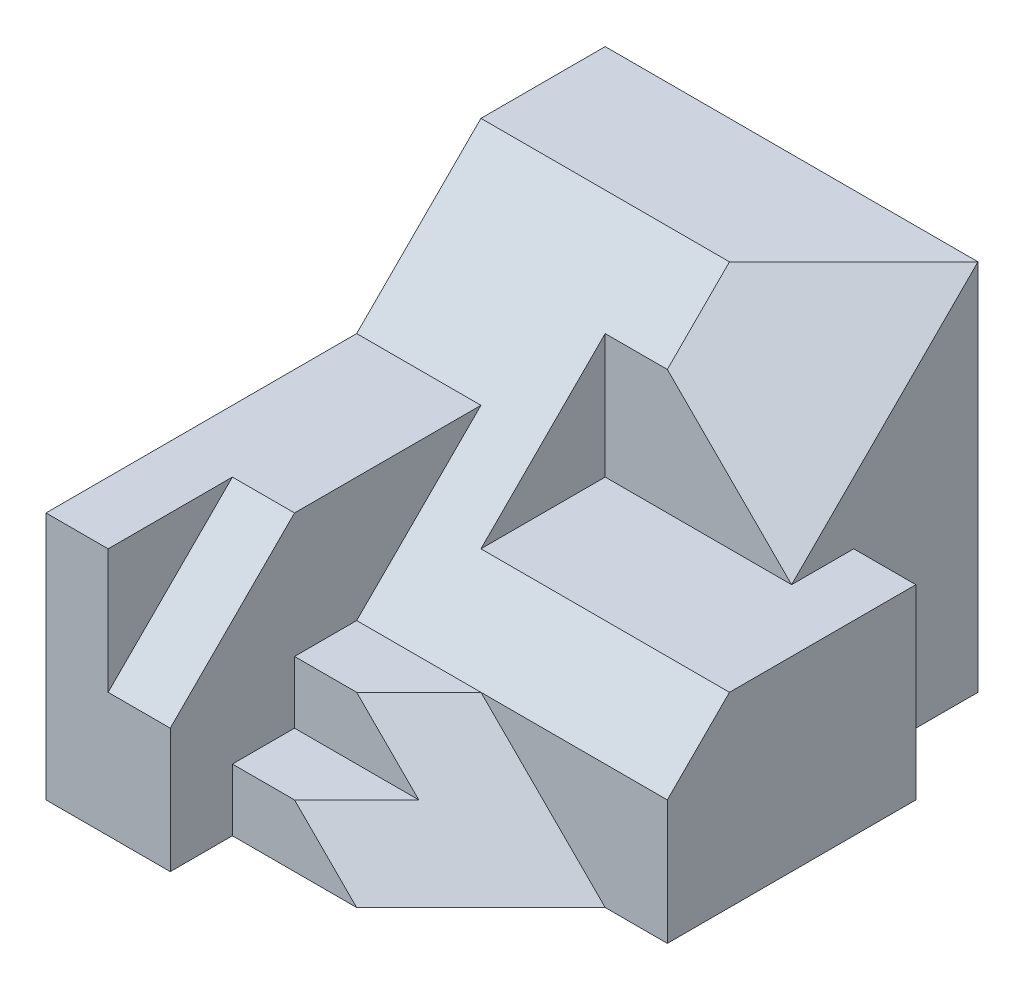
ISO-10303-21;
HEADER;
FILE_DESCRIPTION(('STEP AP214'),'2;1');
FILE_NAME('part.step','',(''),(''),'','','');
FILE_SCHEMA(('AUTOMOTIVE_DESIGN { 1 0 10303 214 1 1 1 1 }'));
ENDSEC;
DATA;
#1=APPLICATION_CONTEXT('core data for automotive mechanical design processes');
#2=APPLICATION_PROTOCOL_DEFINITION('international standard','automotive_design',2000,#1);
#3=PRODUCT_CONTEXT('',#1,'mechanical');
#4=PRODUCT('Part','Part','',(#3));
#5=PRODUCT_RELATED_PRODUCT_CATEGORY('part','',(#4));
#6=PRODUCT_DEFINITION_FORMATION('','',#4);
#7=PRODUCT_DEFINITION_CONTEXT('part definition',#1,'design');
#8=PRODUCT_DEFINITION('design','',#6,#7);
#9=PRODUCT_DEFINITION_SHAPE('','',#8);
#10=(LENGTH_UNIT() NAMED_UNIT(*) SI_UNIT(.MILLI.,.METRE.));
#11=(NAMED_UNIT(*) PLANE_ANGLE_UNIT() SI_UNIT($,.RADIAN.));
#12=(NAMED_UNIT(*) SI_UNIT($,.STERADIAN.) SOLID_ANGLE_UNIT());
#13=UNCERTAINTY_MEASURE_WITH_UNIT(LENGTH_MEASURE(1.E-05),#10,'distance_accuracy_value','');
#14=(GEOMETRIC_REPRESENTATION_CONTEXT(3) GLOBAL_UNCERTAINTY_ASSIGNED_CONTEXT((#13)) GLOBAL_UNIT_ASSIGNED_CONTEXT((#10,
#11,#12)) REPRESENTATION_CONTEXT('',''));
#15=CARTESIAN_POINT('',(0.,0.,0.));
#16=DIRECTION('',(0.,0.,1.));
#17=DIRECTION('',(1.,0.,0.));
#18=AXIS2_PLACEMENT_3D('',#15,#16,#17);
#19=CARTESIAN_POINT('',(2.5,-2.,7.));
#20=DIRECTION('',(0.,-1.,0.));
#21=DIRECTION('',(0.,0.,-1.));
#22=AXIS2_PLACEMENT_3D('',#19,#20,#21);
#23=PLANE('',#22);
#24=DIRECTION('',(-1.,0.,0.));
#25=VECTOR('',#24,1.);
#26=CARTESIAN_POINT('',(2.5,-2.,8.));
#27=LINE('',#26,#25);
#28=CARTESIAN_POINT('',(-0.5,-2.,8.));
#29=VERTEX_POINT('',#28);
#30=CARTESIAN_POINT('',(-1.5,-2.,8.));
#31=VERTEX_POINT('',#30);
#32=EDGE_CURVE('E233',#29,#31,#27,.T.);
#33=ORIENTED_EDGE('',*,*,#32,.F.);
#34=DIRECTION('',(-0.707106781186548,0.,0.707106781186547));
#35=VECTOR('',#34,1.);
#36=CARTESIAN_POINT('',(1.5,-2.,6.));
#37=LINE('',#36,#35);
#38=CARTESIAN_POINT('',(0.500000000000001,-2.,7.));
#39=VERTEX_POINT('',#38);
#40=EDGE_CURVE('E244',#39,#29,#37,.T.);
#41=ORIENTED_EDGE('',*,*,#40,.F.);
#42=DIRECTION('',(-1.,0.,0.));
#43=VECTOR('',#42,1.);
#44=CARTESIAN_POINT('',(2.5,-2.,7.));
#45=LINE('',#44,#43);
#46=CARTESIAN_POINT('',(-1.5,-2.,7.));
#47=VERTEX_POINT('',#46);
#48=EDGE_CURVE('E230',#39,#47,#45,.T.);
#49=ORIENTED_EDGE('',*,*,#48,.T.);
#50=DIRECTION('',(0.,0.,1.));
#51=VECTOR('',#50,1.);
#52=CARTESIAN_POINT('',(-1.5,-2.,7.));
#53=LINE('',#52,#51);
#54=EDGE_CURVE('E232',#47,#31,#53,.T.);
#55=ORIENTED_EDGE('',*,*,#54,.T.);
#56=EDGE_LOOP('',(#33,#41,#49,#55));
#57=FACE_BOUND('',#56,.T.);
#58=ADVANCED_FACE('F33',(#57),#23,.F.);
#59=CARTESIAN_POINT('',(2.5,-2.,8.));
#60=DIRECTION('',(0.,0.,-1.));
#61=DIRECTION('',(-1.,0.,0.));
#62=AXIS2_PLACEMENT_3D('',#59,#60,#61);
#63=PLANE('',#62);
#64=DIRECTION('',(0.707106781186547,-0.707106781186548,0.));
#65=VECTOR('',#64,1.);
#66=CARTESIAN_POINT('',(-0.5,-2.,8.));
#67=LINE('',#66,#65);
#68=CARTESIAN_POINT('',(0.499999999999998,-3.,8.));
#69=VERTEX_POINT('',#68);
#70=EDGE_CURVE('E249',#29,#69,#67,.T.);
#71=ORIENTED_EDGE('',*,*,#70,.F.);
#72=ORIENTED_EDGE('',*,*,#32,.T.);
#73=DIRECTION('',(0.,-1.,0.));
#74=VECTOR('',#73,1.);
#75=CARTESIAN_POINT('',(-1.5,-2.,8.));
#76=LINE('',#75,#74);
#77=CARTESIAN_POINT('',(-1.5,-3.,8.));
#78=VERTEX_POINT('',#77);
#79=EDGE_CURVE('E210',#31,#78,#76,.T.);
#80=ORIENTED_EDGE('',*,*,#79,.T.);
#81=DIRECTION('',(-1.,0.,0.));
#82=VECTOR('',#81,1.);
#83=CARTESIAN_POINT('',(2.5,-3.,8.));
#84=LINE('',#83,#82);
#85=EDGE_CURVE('E37',#69,#78,#84,.T.);
#86=ORIENTED_EDGE('',*,*,#85,.F.);
#87=EDGE_LOOP('',(#71,#72,#80,#86));
#88=FACE_BOUND('',#87,.T.);
#89=ADVANCED_FACE('F348',(#88),#63,.F.);
#90=CARTESIAN_POINT('',(3.5,-3.,9.));
#91=DIRECTION('',(0.,1.,0.));
#92=DIRECTION('',(-1.,0.,0.));
#93=AXIS2_PLACEMENT_3D('',#90,#91,#92);
#94=PLANE('',#93);
#95=DIRECTION('',(0.707106781186547,0.,-0.707106781186548));
#96=VECTOR('',#95,1.);
#97=CARTESIAN_POINT('',(1.5,-3.,7.));
#98=LINE('',#97,#96);
#99=CARTESIAN_POINT('',(2.5,-3.,6.));
#100=VERTEX_POINT('',#99);
#101=EDGE_CURVE('E177',#69,#100,#98,.T.);
#102=ORIENTED_EDGE('',*,*,#101,.F.);
#103=ORIENTED_EDGE('',*,*,#85,.T.);
#104=DIRECTION('',(0.,0.,-1.));
#105=VECTOR('',#104,1.);
#106=CARTESIAN_POINT('',(-1.5,-3.,9.));
#107=LINE('',#106,#105);
#108=CARTESIAN_POINT('',(-1.5,-3.,9.));
#109=VERTEX_POINT('',#108);
#110=EDGE_CURVE('E211',#109,#78,#107,.T.);
#111=ORIENTED_EDGE('',*,*,#110,.F.);
#112=DIRECTION('',(1.,0.,0.));
#113=VECTOR('',#112,1.);
#114=CARTESIAN_POINT('',(3.5,-3.,9.));
#115=LINE('',#114,#113);
#116=CARTESIAN_POINT('',(-3.5,-3.,9.));
#117=VERTEX_POINT('',#116);
#118=EDGE_CURVE('E267',#117,#109,#115,.T.);
#119=ORIENTED_EDGE('',*,*,#118,.F.);
#120=DIRECTION('',(0.,0.,-1.));
#121=VECTOR('',#120,1.);
#122=CARTESIAN_POINT('',(-3.5,-3.,9.));
#123=LINE('',#122,#121);
#124=CARTESIAN_POINT('',(-3.5,-3.,0.));
#125=VERTEX_POINT('',#124);
#126=EDGE_CURVE('E250',#117,#125,#123,.T.);
#127=ORIENTED_EDGE('',*,*,#126,.T.);
#128=DIRECTION('',(1.,0.,0.));
#129=VECTOR('',#128,1.);
#130=CARTESIAN_POINT('',(3.5,-3.,0.));
#131=LINE('',#130,#129);
#132=CARTESIAN_POINT('',(2.5,-3.,0.));
#133=VERTEX_POINT('',#132);
#134=EDGE_CURVE('E253',#125,#133,#131,.T.);
#135=ORIENTED_EDGE('',*,*,#134,.T.);
#136=DIRECTION('',(0.,0.,-1.));
#137=VECTOR('',#136,1.);
#138=CARTESIAN_POINT('',(2.5,-3.,0.));
#139=LINE('',#138,#137);
#140=CARTESIAN_POINT('',(2.5,-3.,2.));
#141=VERTEX_POINT('',#140);
#142=EDGE_CURVE('E290',#141,#133,#139,.T.);
#143=ORIENTED_EDGE('',*,*,#142,.F.);
#144=DIRECTION('',(1.,0.,0.));
#145=VECTOR('',#144,1.);
#146=CARTESIAN_POINT('',(2.5,-3.,2.));
#147=LINE('',#146,#145);
#148=CARTESIAN_POINT('',(3.5,-3.,2.));
#149=VERTEX_POINT('',#148);
#150=EDGE_CURVE('E242',#141,#149,#147,.T.);
#151=ORIENTED_EDGE('',*,*,#150,.T.);
#152=DIRECTION('',(0.,0.,-1.));
#153=VECTOR('',#152,1.);
#154=CARTESIAN_POINT('',(3.5,-3.,9.));
#155=LINE('',#154,#153);
#156=CARTESIAN_POINT('',(3.5,-3.,6.));
#157=VERTEX_POINT('',#156);
#158=EDGE_CURVE('E254',#157,#149,#155,.T.);
#159=ORIENTED_EDGE('',*,*,#158,.F.);
#160=DIRECTION('',(1.,0.,0.));
#161=VECTOR('',#160,1.);
#162=CARTESIAN_POINT('',(-1.5,-3.,6.));
#163=LINE('',#162,#161);
#164=EDGE_CURVE('E197',#100,#157,#163,.T.);
#165=ORIENTED_EDGE('',*,*,#164,.F.);
#166=EDGE_LOOP('',(#102,#103,#111,#119,#127,#135,#143,#151,#159,#165));
#167=FACE_BOUND('',#166,.T.);
#168=ADVANCED_FACE('F35',(#167),#94,.F.);
#169=CARTESIAN_POINT('',(2.5,-0.999999999999999,6.));
#170=DIRECTION('',(0.,-1.,0.));
#171=DIRECTION('',(0.,0.,-1.));
#172=AXIS2_PLACEMENT_3D('',#169,#170,#171);
#173=PLANE('',#172);
#174=DIRECTION('',(-0.707106781186547,0.,0.707106781186548));
#175=VECTOR('',#174,1.);
#176=CARTESIAN_POINT('',(-0.500000000000002,-0.999999999999998,7.));
#177=LINE('',#176,#175);
#178=CARTESIAN_POINT('',(0.499999999999999,-0.999999999999998,6.));
#179=VERTEX_POINT('',#178);
#180=CARTESIAN_POINT('',(-0.500000000000002,-0.999999999999998,7.));
#181=VERTEX_POINT('',#180);
#182=EDGE_CURVE('E11',#179,#181,#177,.T.);
#183=ORIENTED_EDGE('',*,*,#182,.F.);
#184=DIRECTION('',(1.,0.,0.));
#185=VECTOR('',#184,1.);
#186=CARTESIAN_POINT('',(-1.5,-0.999999999999999,6.));
#187=LINE('',#186,#185);
#188=CARTESIAN_POINT('',(-1.5,-0.999999999999999,6.));
#189=VERTEX_POINT('',#188);
#190=EDGE_CURVE('E173',#189,#179,#187,.T.);
#191=ORIENTED_EDGE('',*,*,#190,.F.);
#192=DIRECTION('',(0.,0.,1.));
#193=VECTOR('',#192,1.);
#194=CARTESIAN_POINT('',(-1.5,-0.999999999999999,6.));
#195=LINE('',#194,#193);
#196=CARTESIAN_POINT('',(-1.5,-0.999999999999999,7.));
#197=VERTEX_POINT('',#196);
#198=EDGE_CURVE('E229',#189,#197,#195,.T.);
#199=ORIENTED_EDGE('',*,*,#198,.T.);
#200=DIRECTION('',(-1.,0.,0.));
#201=VECTOR('',#200,1.);
#202=CARTESIAN_POINT('',(2.5,-0.999999999999999,7.));
#203=LINE('',#202,#201);
#204=EDGE_CURVE('E185',#181,#197,#203,.T.);
#205=ORIENTED_EDGE('',*,*,#204,.F.);
#206=EDGE_LOOP('',(#183,#191,#199,#205));
#207=FACE_BOUND('',#206,.T.);
#208=ADVANCED_FACE('F183',(#207),#173,.F.);
#209=CARTESIAN_POINT('',(2.5,-0.999999999999999,7.));
#210=DIRECTION('',(0.,0.,-1.));
#211=DIRECTION('',(-1.,0.,0.));
#212=AXIS2_PLACEMENT_3D('',#209,#210,#211);
#213=PLANE('',#212);
#214=DIRECTION('',(0.707106781186547,-0.707106781186548,0.));
#215=VECTOR('',#214,1.);
#216=CARTESIAN_POINT('',(0.999999999999999,-2.5,7.));
#217=LINE('',#216,#215);
#218=EDGE_CURVE('E52',#181,#39,#217,.T.);
#219=ORIENTED_EDGE('',*,*,#218,.F.);
#220=ORIENTED_EDGE('',*,*,#204,.T.);
#221=DIRECTION('',(0.,-1.,0.));
#222=VECTOR('',#221,1.);
#223=CARTESIAN_POINT('',(-1.5,-0.999999999999999,7.));
#224=LINE('',#223,#222);
#225=EDGE_CURVE('E228',#197,#47,#224,.T.);
#226=ORIENTED_EDGE('',*,*,#225,.T.);
#227=ORIENTED_EDGE('',*,*,#48,.F.);
#228=EDGE_LOOP('',(#219,#220,#226,#227));
#229=FACE_BOUND('',#228,.T.);
#230=ADVANCED_FACE('F353',(#229),#213,.F.);
#231=CARTESIAN_POINT('',(-1.5,0.,0.));
#232=DIRECTION('',(1.,0.,0.));
#233=DIRECTION('',(0.,0.,-1.));
#234=AXIS2_PLACEMENT_3D('',#231,#232,#233);
#235=PLANE('',#234);
#236=ORIENTED_EDGE('',*,*,#225,.F.);
#237=ORIENTED_EDGE('',*,*,#198,.F.);
#238=DIRECTION('',(0.,0.707106781186547,-0.707106781186548));
#239=VECTOR('',#238,1.);
#240=CARTESIAN_POINT('',(-1.5,0.,5.));
#241=LINE('',#240,#239);
#242=CARTESIAN_POINT('',(-1.5,1.,4.));
#243=VERTEX_POINT('',#242);
#244=EDGE_CURVE('E190',#189,#243,#241,.T.);
#245=ORIENTED_EDGE('',*,*,#244,.T.);
#246=DIRECTION('',(0.,0.,1.));
#247=VECTOR('',#246,1.);
#248=CARTESIAN_POINT('',(-1.5,1.,6.));
#249=LINE('',#248,#247);
#250=CARTESIAN_POINT('',(-1.5,1.,7.));
#251=VERTEX_POINT('',#250);
#252=EDGE_CURVE('E209',#243,#251,#249,.T.);
#253=ORIENTED_EDGE('',*,*,#252,.T.);
#254=DIRECTION('',(0.,-0.707106781186548,0.707106781186548));
#255=VECTOR('',#254,1.);
#256=CARTESIAN_POINT('',(-1.5,1.,7.));
#257=LINE('',#256,#255);
#258=CARTESIAN_POINT('',(-1.5,-0.999999999999999,9.));
#259=VERTEX_POINT('',#258);
#260=EDGE_CURVE('E217',#251,#259,#257,.T.);
#261=ORIENTED_EDGE('',*,*,#260,.T.);
#262=DIRECTION('',(0.,-1.,0.));
#263=VECTOR('',#262,1.);
#264=CARTESIAN_POINT('',(-1.5,-0.999999999999999,9.));
#265=LINE('',#264,#263);
#266=EDGE_CURVE('E215',#259,#109,#265,.T.);
#267=ORIENTED_EDGE('',*,*,#266,.T.);
#268=ORIENTED_EDGE('',*,*,#110,.T.);
#269=ORIENTED_EDGE('',*,*,#79,.F.);
#270=ORIENTED_EDGE('',*,*,#54,.F.);
#271=EDGE_LOOP('',(#236,#237,#245,#253,#261,#267,#268,#269,#270));
#272=FACE_BOUND('',#271,.T.);
#273=ADVANCED_FACE('F345',(#272),#235,.T.);
#274=CARTESIAN_POINT('',(3.5,3.,9.));
#275=DIRECTION('',(0.,-1.,0.));
#276=DIRECTION('',(1.,0.,0.));
#277=AXIS2_PLACEMENT_3D('',#274,#275,#276);
#278=PLANE('',#277);
#279=DIRECTION('',(-0.707106781186547,0.,0.707106781186548));
#280=VECTOR('',#279,1.);
#281=CARTESIAN_POINT('',(2.5,3.,0.));
#282=LINE('',#281,#280);
#283=CARTESIAN_POINT('',(2.5,3.,0.));
#284=VERTEX_POINT('',#283);
#285=CARTESIAN_POINT('',(0.499999999999999,3.,2.));
#286=VERTEX_POINT('',#285);
#287=EDGE_CURVE('E207',#284,#286,#282,.T.);
#288=ORIENTED_EDGE('',*,*,#287,.F.);
#289=DIRECTION('',(-1.,0.,0.));
#290=VECTOR('',#289,1.);
#291=CARTESIAN_POINT('',(3.5,3.,0.));
#292=LINE('',#291,#290);
#293=CARTESIAN_POINT('',(-3.5,3.,0.));
#294=VERTEX_POINT('',#293);
#295=EDGE_CURVE('E214',#284,#294,#292,.T.);
#296=ORIENTED_EDGE('',*,*,#295,.T.);
#297=DIRECTION('',(0.,0.,-1.));
#298=VECTOR('',#297,1.);
#299=CARTESIAN_POINT('',(-3.5,3.,9.));
#300=LINE('',#299,#298);
#301=CARTESIAN_POINT('',(-3.5,3.,2.));
#302=VERTEX_POINT('',#301);
#303=EDGE_CURVE('E256',#302,#294,#300,.T.);
#304=ORIENTED_EDGE('',*,*,#303,.F.);
#305=DIRECTION('',(-1.,0.,0.));
#306=VECTOR('',#305,1.);
#307=CARTESIAN_POINT('',(-1.5,3.,2.));
#308=LINE('',#307,#306);
#309=EDGE_CURVE('E193',#286,#302,#308,.T.);
#310=ORIENTED_EDGE('',*,*,#309,.F.);
#311=EDGE_LOOP('',(#288,#296,#304,#310));
#312=FACE_BOUND('',#311,.T.);
#313=ADVANCED_FACE('F360',(#312),#278,.F.);
#314=CARTESIAN_POINT('',(-1.5,3.,2.));
#315=DIRECTION('',(0.,-0.707106781186547,-0.707106781186548));
#316=DIRECTION('',(0.,0.707106781186548,-0.707106781186547));
#317=AXIS2_PLACEMENT_3D('',#314,#315,#316);
#318=PLANE('',#317);
#319=DIRECTION('',(0.,-0.707106781186548,0.707106781186548));
#320=VECTOR('',#319,1.);
#321=CARTESIAN_POINT('',(0.499999999999999,3.,2.));
#322=LINE('',#321,#320);
#323=CARTESIAN_POINT('',(0.499999999999999,2.,3.));
#324=VERTEX_POINT('',#323);
#325=EDGE_CURVE('E224',#286,#324,#322,.T.);
#326=ORIENTED_EDGE('',*,*,#325,.F.);
#327=ORIENTED_EDGE('',*,*,#309,.T.);
#328=DIRECTION('',(0.,-0.707106781186548,0.707106781186547));
#329=VECTOR('',#328,1.);
#330=CARTESIAN_POINT('',(-3.5,3.,2.));
#331=LINE('',#330,#329);
#332=CARTESIAN_POINT('',(-3.5,1.,4.));
#333=VERTEX_POINT('',#332);
#334=EDGE_CURVE('E191',#302,#333,#331,.T.);
#335=ORIENTED_EDGE('',*,*,#334,.T.);
#336=DIRECTION('',(-1.,0.,0.));
#337=VECTOR('',#336,1.);
#338=CARTESIAN_POINT('',(-1.5,1.,4.));
#339=LINE('',#338,#337);
#340=EDGE_CURVE('E275',#243,#333,#339,.T.);
#341=ORIENTED_EDGE('',*,*,#340,.F.);
#342=ORIENTED_EDGE('',*,*,#244,.F.);
#343=ORIENTED_EDGE('',*,*,#190,.T.);
#344=CARTESIAN_POINT('',(3.5,-0.999999999999999,6.));
#345=VERTEX_POINT('',#344);
#346=EDGE_CURVE('E164',#179,#345,#187,.T.);
#347=ORIENTED_EDGE('',*,*,#346,.T.);
#348=DIRECTION('',(0.,0.707106781186547,-0.707106781186548));
#349=VECTOR('',#348,1.);
#350=CARTESIAN_POINT('',(3.5,0.,5.));
#351=LINE('',#350,#349);
#352=CARTESIAN_POINT('',(3.5,0.,5.));
#353=VERTEX_POINT('',#352);
#354=EDGE_CURVE('E172',#345,#353,#351,.T.);
#355=ORIENTED_EDGE('',*,*,#354,.T.);
#356=DIRECTION('',(1.,0.,0.));
#357=VECTOR('',#356,1.);
#358=CARTESIAN_POINT('',(-1.5,0.,5.));
#359=LINE('',#358,#357);
#360=CARTESIAN_POINT('',(-0.500000000000002,0.,5.));
#361=VERTEX_POINT('',#360);
#362=EDGE_CURVE('E199',#361,#353,#359,.T.);
#363=ORIENTED_EDGE('',*,*,#362,.F.);
#364=DIRECTION('',(0.,-0.707106781186548,0.707106781186547));
#365=VECTOR('',#364,1.);
#366=CARTESIAN_POINT('',(-0.500000000000002,2.,3.));
#367=LINE('',#366,#365);
#368=CARTESIAN_POINT('',(-0.500000000000002,2.,3.));
#369=VERTEX_POINT('',#368);
#370=EDGE_CURVE('E289',#369,#361,#367,.T.);
#371=ORIENTED_EDGE('',*,*,#370,.F.);
#372=DIRECTION('',(1.,0.,0.));
#373=VECTOR('',#372,1.);
#374=CARTESIAN_POINT('',(-0.500000000000002,2.,3.));
#375=LINE('',#374,#373);
#376=EDGE_CURVE('E205',#369,#324,#375,.T.);
#377=ORIENTED_EDGE('',*,*,#376,.T.);
#378=EDGE_LOOP('',(#326,#327,#335,#341,#342,#343,#347,#355,#363,#371,#377));
#379=FACE_BOUND('',#378,.T.);
#380=ADVANCED_FACE('F188',(#379),#318,.F.);
#381=CARTESIAN_POINT('',(2.5,0.,0.));
#382=DIRECTION('',(-1.,0.,0.));
#383=DIRECTION('',(0.,0.,1.));
#384=AXIS2_PLACEMENT_3D('',#381,#382,#383);
#385=PLANE('',#384);
#386=DIRECTION('',(0.,0.707106781186547,-0.707106781186548));
#387=VECTOR('',#386,1.);
#388=CARTESIAN_POINT('',(2.5,0.,3.));
#389=LINE('',#388,#387);
#390=CARTESIAN_POINT('',(2.5,0.,3.));
#391=VERTEX_POINT('',#390);
#392=EDGE_CURVE('E220',#391,#284,#389,.T.);
#393=ORIENTED_EDGE('',*,*,#392,.F.);
#394=DIRECTION('',(0.,0.,-1.));
#395=VECTOR('',#394,1.);
#396=CARTESIAN_POINT('',(2.5,0.,2.));
#397=LINE('',#396,#395);
#398=CARTESIAN_POINT('',(2.5,0.,2.));
#399=VERTEX_POINT('',#398);
#400=EDGE_CURVE('E296',#391,#399,#397,.T.);
#401=ORIENTED_EDGE('',*,*,#400,.T.);
#402=DIRECTION('',(0.,-1.,0.));
#403=VECTOR('',#402,1.);
#404=CARTESIAN_POINT('',(2.5,-3.,2.));
#405=LINE('',#404,#403);
#406=EDGE_CURVE('E293',#399,#141,#405,.T.);
#407=ORIENTED_EDGE('',*,*,#406,.T.);
#408=ORIENTED_EDGE('',*,*,#142,.T.);
#409=DIRECTION('',(0.,1.,0.));
#410=VECTOR('',#409,1.);
#411=CARTESIAN_POINT('',(2.5,3.,0.));
#412=LINE('',#411,#410);
#413=EDGE_CURVE('E292',#133,#284,#412,.T.);
#414=ORIENTED_EDGE('',*,*,#413,.T.);
#415=EDGE_LOOP('',(#393,#401,#407,#408,#414));
#416=FACE_BOUND('',#415,.T.);
#417=ADVANCED_FACE('F396',(#416),#385,.F.);
#418=CARTESIAN_POINT('',(-0.500000000000002,0.,3.));
#419=DIRECTION('',(0.,0.,-1.));
#420=DIRECTION('',(0.,1.,0.));
#421=AXIS2_PLACEMENT_3D('',#418,#419,#420);
#422=PLANE('',#421);
#423=DIRECTION('',(0.707106781186547,-0.707106781186548,0.));
#424=VECTOR('',#423,1.);
#425=CARTESIAN_POINT('',(0.499999999999999,2.,3.));
#426=LINE('',#425,#424);
#427=EDGE_CURVE('E222',#324,#391,#426,.T.);
#428=ORIENTED_EDGE('',*,*,#427,.F.);
#429=ORIENTED_EDGE('',*,*,#376,.F.);
#430=DIRECTION('',(0.,1.,0.));
#431=VECTOR('',#430,1.);
#432=CARTESIAN_POINT('',(-0.500000000000002,0.,3.));
#433=LINE('',#432,#431);
#434=CARTESIAN_POINT('',(-0.500000000000002,0.,3.));
#435=VERTEX_POINT('',#434);
#436=EDGE_CURVE('E304',#435,#369,#433,.T.);
#437=ORIENTED_EDGE('',*,*,#436,.F.);
#438=DIRECTION('',(1.,0.,0.));
#439=VECTOR('',#438,1.);
#440=CARTESIAN_POINT('',(-0.500000000000002,0.,3.));
#441=LINE('',#440,#439);
#442=EDGE_CURVE('E278',#435,#391,#441,.T.);
#443=ORIENTED_EDGE('',*,*,#442,.T.);
#444=EDGE_LOOP('',(#428,#429,#437,#443));
#445=FACE_BOUND('',#444,.T.);
#446=ADVANCED_FACE('F393',(#445),#422,.F.);
#447=CARTESIAN_POINT('',(-1.5,1.,4.));
#448=DIRECTION('',(0.,-1.,0.));
#449=DIRECTION('',(0.,0.,-1.));
#450=AXIS2_PLACEMENT_3D('',#447,#448,#449);
#451=PLANE('',#450);
#452=ORIENTED_EDGE('',*,*,#252,.F.);
#453=ORIENTED_EDGE('',*,*,#340,.T.);
#454=DIRECTION('',(0.,0.,1.));
#455=VECTOR('',#454,1.);
#456=CARTESIAN_POINT('',(-3.5,1.,4.));
#457=LINE('',#456,#455);
#458=CARTESIAN_POINT('',(-3.5,1.,9.));
#459=VERTEX_POINT('',#458);
#460=EDGE_CURVE('E277',#333,#459,#457,.T.);
#461=ORIENTED_EDGE('',*,*,#460,.T.);
#462=DIRECTION('',(-1.,0.,0.));
#463=VECTOR('',#462,1.);
#464=CARTESIAN_POINT('',(-1.5,1.,9.));
#465=LINE('',#464,#463);
#466=CARTESIAN_POINT('',(-2.5,1.,9.));
#467=VERTEX_POINT('',#466);
#468=EDGE_CURVE('E270',#467,#459,#465,.T.);
#469=ORIENTED_EDGE('',*,*,#468,.F.);
#470=DIRECTION('',(0.,0.,1.));
#471=VECTOR('',#470,1.);
#472=CARTESIAN_POINT('',(-2.5,1.,9.));
#473=LINE('',#472,#471);
#474=CARTESIAN_POINT('',(-2.5,1.,7.));
#475=VERTEX_POINT('',#474);
#476=EDGE_CURVE('E307',#475,#467,#473,.T.);
#477=ORIENTED_EDGE('',*,*,#476,.F.);
#478=DIRECTION('',(1.,0.,0.));
#479=VECTOR('',#478,1.);
#480=CARTESIAN_POINT('',(-2.5,1.,7.));
#481=LINE('',#480,#479);
#482=EDGE_CURVE('E271',#475,#251,#481,.T.);
#483=ORIENTED_EDGE('',*,*,#482,.T.);
#484=EDGE_LOOP('',(#452,#453,#461,#469,#477,#483));
#485=FACE_BOUND('',#484,.T.);
#486=ADVANCED_FACE('F331',(#485),#451,.F.);
#487=CARTESIAN_POINT('',(0.,0.,9.));
#488=DIRECTION('',(0.,0.,1.));
#489=DIRECTION('',(1.,0.,0.));
#490=AXIS2_PLACEMENT_3D('',#487,#488,#489);
#491=PLANE('',#490);
#492=ORIENTED_EDGE('',*,*,#118,.T.);
#493=ORIENTED_EDGE('',*,*,#266,.F.);
#494=DIRECTION('',(1.,0.,0.));
#495=VECTOR('',#494,1.);
#496=CARTESIAN_POINT('',(-2.5,-0.999999999999999,9.));
#497=LINE('',#496,#495);
#498=CARTESIAN_POINT('',(-2.5,-0.999999999999999,9.));
#499=VERTEX_POINT('',#498);
#500=EDGE_CURVE('E257',#499,#259,#497,.T.);
#501=ORIENTED_EDGE('',*,*,#500,.F.);
#502=DIRECTION('',(0.,-1.,0.));
#503=VECTOR('',#502,1.);
#504=CARTESIAN_POINT('',(-2.5,-0.999999999999999,9.));
#505=LINE('',#504,#503);
#506=EDGE_CURVE('E317',#467,#499,#505,.T.);
#507=ORIENTED_EDGE('',*,*,#506,.F.);
#508=ORIENTED_EDGE('',*,*,#468,.T.);
#509=DIRECTION('',(0.,-1.,0.));
#510=VECTOR('',#509,1.);
#511=CARTESIAN_POINT('',(-3.5,-3.,9.));
#512=LINE('',#511,#510);
#513=EDGE_CURVE('E272',#459,#117,#512,.T.);
#514=ORIENTED_EDGE('',*,*,#513,.T.);
#515=EDGE_LOOP('',(#492,#493,#501,#507,#508,#514));
#516=FACE_BOUND('',#515,.T.);
#517=ADVANCED_FACE('F328',(#516),#491,.T.);
#518=CARTESIAN_POINT('',(-2.5,1.,7.));
#519=DIRECTION('',(0.,-0.707106781186547,-0.707106781186547));
#520=DIRECTION('',(0.,0.707106781186548,-0.707106781186548));
#521=AXIS2_PLACEMENT_3D('',#518,#519,#520);
#522=PLANE('',#521);
#523=ORIENTED_EDGE('',*,*,#260,.F.);
#524=ORIENTED_EDGE('',*,*,#482,.F.);
#525=DIRECTION('',(0.,0.707106781186548,-0.707106781186548));
#526=VECTOR('',#525,1.);
#527=CARTESIAN_POINT('',(-2.5,1.,7.));
#528=LINE('',#527,#526);
#529=EDGE_CURVE('E315',#499,#475,#528,.T.);
#530=ORIENTED_EDGE('',*,*,#529,.F.);
#531=ORIENTED_EDGE('',*,*,#500,.T.);
#532=EDGE_LOOP('',(#523,#524,#530,#531));
#533=FACE_BOUND('',#532,.T.);
#534=ADVANCED_FACE('F384',(#533),#522,.F.);
#535=CARTESIAN_POINT('',(3.5,-3.,9.));
#536=DIRECTION('',(-1.,0.,0.));
#537=DIRECTION('',(0.,0.,1.));
#538=AXIS2_PLACEMENT_3D('',#535,#536,#537);
#539=PLANE('',#538);
#540=DIRECTION('',(0.,0.,-1.));
#541=VECTOR('',#540,1.);
#542=CARTESIAN_POINT('',(3.5,0.,2.));
#543=LINE('',#542,#541);
#544=CARTESIAN_POINT('',(3.5,0.,2.));
#545=VERTEX_POINT('',#544);
#546=EDGE_CURVE('E202',#353,#545,#543,.T.);
#547=ORIENTED_EDGE('',*,*,#546,.F.);
#548=ORIENTED_EDGE('',*,*,#354,.F.);
#549=DIRECTION('',(0.,1.,0.));
#550=VECTOR('',#549,1.);
#551=CARTESIAN_POINT('',(3.5,-0.999999999999999,6.));
#552=LINE('',#551,#550);
#553=EDGE_CURVE('E168',#157,#345,#552,.T.);
#554=ORIENTED_EDGE('',*,*,#553,.F.);
#555=ORIENTED_EDGE('',*,*,#158,.T.);
#556=DIRECTION('',(0.,-1.,0.));
#557=VECTOR('',#556,1.);
#558=CARTESIAN_POINT('',(3.5,-3.,2.));
#559=LINE('',#558,#557);
#560=EDGE_CURVE('E266',#545,#149,#559,.T.);
#561=ORIENTED_EDGE('',*,*,#560,.F.);
#562=EDGE_LOOP('',(#547,#548,#554,#555,#561));
#563=FACE_BOUND('',#562,.T.);
#564=ADVANCED_FACE('F387',(#563),#539,.F.);
#565=CARTESIAN_POINT('',(-3.5,-3.,9.));
#566=DIRECTION('',(1.,0.,0.));
#567=DIRECTION('',(0.,0.,-1.));
#568=AXIS2_PLACEMENT_3D('',#565,#566,#567);
#569=PLANE('',#568);
#570=ORIENTED_EDGE('',*,*,#513,.F.);
#571=ORIENTED_EDGE('',*,*,#460,.F.);
#572=ORIENTED_EDGE('',*,*,#334,.F.);
#573=ORIENTED_EDGE('',*,*,#303,.T.);
#574=DIRECTION('',(0.,-1.,0.));
#575=VECTOR('',#574,1.);
#576=CARTESIAN_POINT('',(-3.5,-3.,0.));
#577=LINE('',#576,#575);
#578=EDGE_CURVE('E260',#294,#125,#577,.T.);
#579=ORIENTED_EDGE('',*,*,#578,.T.);
#580=ORIENTED_EDGE('',*,*,#126,.F.);
#581=EDGE_LOOP('',(#570,#571,#572,#573,#579,#580));
#582=FACE_BOUND('',#581,.T.);
#583=ADVANCED_FACE('F337',(#582),#569,.F.);
#584=CARTESIAN_POINT('',(0.,0.,0.));
#585=DIRECTION('',(0.,0.,1.));
#586=DIRECTION('',(1.,0.,0.));
#587=AXIS2_PLACEMENT_3D('',#584,#585,#586);
#588=PLANE('',#587);
#589=ORIENTED_EDGE('',*,*,#295,.F.);
#590=ORIENTED_EDGE('',*,*,#413,.F.);
#591=ORIENTED_EDGE('',*,*,#134,.F.);
#592=ORIENTED_EDGE('',*,*,#578,.F.);
#593=EDGE_LOOP('',(#589,#590,#591,#592));
#594=FACE_BOUND('',#593,.T.);
#595=ADVANCED_FACE('F404',(#594),#588,.F.);
#596=CARTESIAN_POINT('',(2.5,-3.,2.));
#597=DIRECTION('',(0.,0.,1.));
#598=DIRECTION('',(1.,0.,0.));
#599=AXIS2_PLACEMENT_3D('',#596,#597,#598);
#600=PLANE('',#599);
#601=ORIENTED_EDGE('',*,*,#560,.T.);
#602=ORIENTED_EDGE('',*,*,#150,.F.);
#603=ORIENTED_EDGE('',*,*,#406,.F.);
#604=DIRECTION('',(1.,0.,0.));
#605=VECTOR('',#604,1.);
#606=CARTESIAN_POINT('',(2.5,0.,2.));
#607=LINE('',#606,#605);
#608=EDGE_CURVE('E203',#399,#545,#607,.T.);
#609=ORIENTED_EDGE('',*,*,#608,.T.);
#610=EDGE_LOOP('',(#601,#602,#603,#609));
#611=FACE_BOUND('',#610,.T.);
#612=ADVANCED_FACE('F401',(#611),#600,.F.);
#613=CARTESIAN_POINT('',(2.5,0.,2.));
#614=DIRECTION('',(0.,-1.,0.));
#615=DIRECTION('',(0.,0.,-1.));
#616=AXIS2_PLACEMENT_3D('',#613,#614,#615);
#617=PLANE('',#616);
#618=DIRECTION('',(0.,0.,-1.));
#619=VECTOR('',#618,1.);
#620=CARTESIAN_POINT('',(-0.500000000000002,0.,5.));
#621=LINE('',#620,#619);
#622=EDGE_CURVE('E308',#361,#435,#621,.T.);
#623=ORIENTED_EDGE('',*,*,#622,.F.);
#624=ORIENTED_EDGE('',*,*,#362,.T.);
#625=ORIENTED_EDGE('',*,*,#546,.T.);
#626=ORIENTED_EDGE('',*,*,#608,.F.);
#627=ORIENTED_EDGE('',*,*,#400,.F.);
#628=ORIENTED_EDGE('',*,*,#442,.F.);
#629=EDGE_LOOP('',(#623,#624,#625,#626,#627,#628));
#630=FACE_BOUND('',#629,.T.);
#631=ADVANCED_FACE('F391',(#630),#617,.F.);
#632=CARTESIAN_POINT('',(-0.500000000000002,0.,0.));
#633=DIRECTION('',(1.,0.,0.));
#634=DIRECTION('',(0.,0.,-1.));
#635=AXIS2_PLACEMENT_3D('',#632,#633,#634);
#636=PLANE('',#635);
#637=ORIENTED_EDGE('',*,*,#370,.T.);
#638=ORIENTED_EDGE('',*,*,#622,.T.);
#639=ORIENTED_EDGE('',*,*,#436,.T.);
#640=EDGE_LOOP('',(#637,#638,#639));
#641=FACE_BOUND('',#640,.T.);
#642=ADVANCED_FACE('F383',(#641),#636,.T.);
#643=CARTESIAN_POINT('',(-2.5,0.,0.));
#644=DIRECTION('',(1.,0.,0.));
#645=DIRECTION('',(0.,0.,-1.));
#646=AXIS2_PLACEMENT_3D('',#643,#644,#645);
#647=PLANE('',#646);
#648=ORIENTED_EDGE('',*,*,#476,.T.);
#649=ORIENTED_EDGE('',*,*,#506,.T.);
#650=ORIENTED_EDGE('',*,*,#529,.T.);
#651=EDGE_LOOP('',(#648,#649,#650));
#652=FACE_BOUND('',#651,.T.);
#653=ADVANCED_FACE('F321',(#652),#647,.T.);
#654=CARTESIAN_POINT('',(-1.5,-0.999999999999999,6.));
#655=DIRECTION('',(0.,0.,-1.));
#656=DIRECTION('',(-1.,0.,0.));
#657=AXIS2_PLACEMENT_3D('',#654,#655,#656);
#658=PLANE('',#657);
#659=ORIENTED_EDGE('',*,*,#553,.T.);
#660=ORIENTED_EDGE('',*,*,#346,.F.);
#661=DIRECTION('',(-0.707106781186547,0.707106781186548,0.));
#662=VECTOR('',#661,1.);
#663=CARTESIAN_POINT('',(2.5,-3.,6.));
#664=LINE('',#663,#662);
#665=EDGE_CURVE('E42',#100,#179,#664,.T.);
#666=ORIENTED_EDGE('',*,*,#665,.F.);
#667=ORIENTED_EDGE('',*,*,#164,.T.);
#668=EDGE_LOOP('',(#659,#660,#666,#667));
#669=FACE_BOUND('',#668,.T.);
#670=ADVANCED_FACE('F165',(#669),#658,.F.);
#671=CARTESIAN_POINT('',(1.83333333333333,1.83333333333333,1.83333333333333));
#672=DIRECTION('',(0.577350269189626,0.577350269189626,0.577350269189626));
#673=DIRECTION('',(-0.707106781186547,0.707106781186548,0.));
#674=AXIS2_PLACEMENT_3D('',#671,#672,#673);
#675=PLANE('',#674);
#676=ORIENTED_EDGE('',*,*,#287,.T.);
#677=ORIENTED_EDGE('',*,*,#325,.T.);
#678=ORIENTED_EDGE('',*,*,#427,.T.);
#679=ORIENTED_EDGE('',*,*,#392,.T.);
#680=EDGE_LOOP('',(#676,#677,#678,#679));
#681=FACE_BOUND('',#680,.T.);
#682=ADVANCED_FACE('F370',(#681),#675,.T.);
#683=CARTESIAN_POINT('',(1.83333333333333,1.83333333333333,1.83333333333333));
#684=DIRECTION('',(0.577350269189626,0.577350269189626,0.577350269189626));
#685=DIRECTION('',(0.707106781186547,0.,-0.707106781186548));
#686=AXIS2_PLACEMENT_3D('',#683,#684,#685);
#687=PLANE('',#686);
#688=ORIENTED_EDGE('',*,*,#40,.T.);
#689=ORIENTED_EDGE('',*,*,#70,.T.);
#690=ORIENTED_EDGE('',*,*,#101,.T.);
#691=ORIENTED_EDGE('',*,*,#665,.T.);
#692=ORIENTED_EDGE('',*,*,#182,.T.);
#693=ORIENTED_EDGE('',*,*,#218,.T.);
#694=EDGE_LOOP('',(#688,#689,#690,#691,#692,#693));
#695=FACE_BOUND('',#694,.T.);
#696=ADVANCED_FACE('F175',(#695),#687,.T.);
#697=CLOSED_SHELL('',(#58,#89,#168,#208,#230,#273,#313,#380,#417,#446,#486,#517,#534,#564,#583,
#595,#612,#631,#642,#653,#670,#682,#696));
#698=MANIFOLD_SOLID_BREP('B2',#697);
#699=ADVANCED_BREP_SHAPE_REPRESENTATION('',(#18,#698),#14);
#700=SHAPE_DEFINITION_REPRESENTATION(#9,#699);
ENDSEC;
END-ISO-10303-21;
